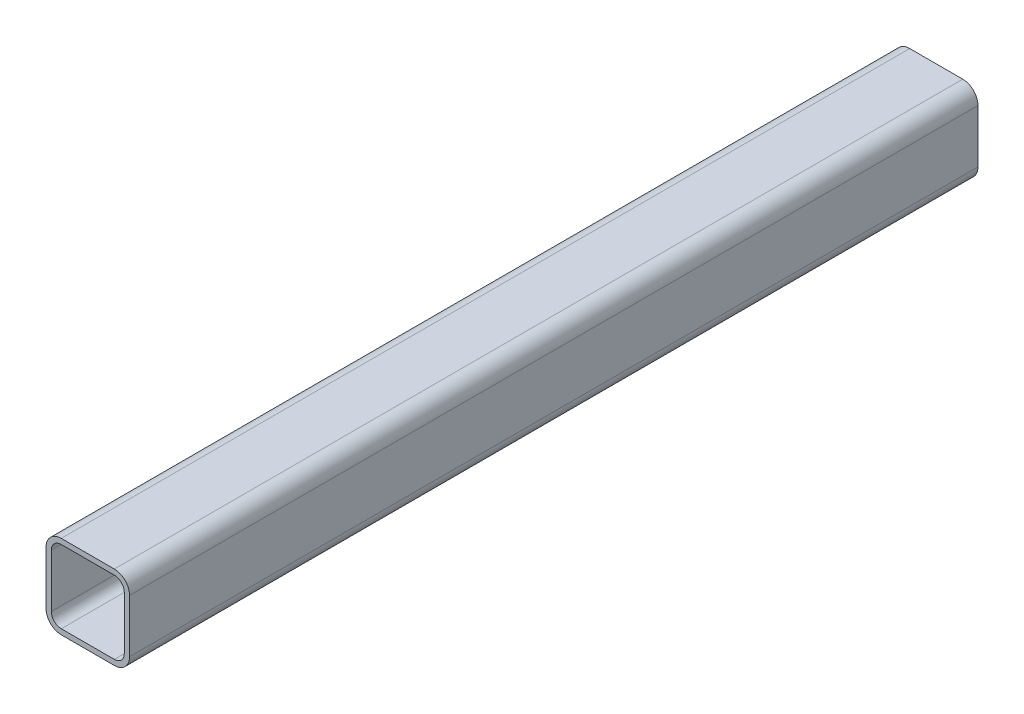
ISO-10303-21;
HEADER;
FILE_DESCRIPTION(('STEP AP214'),'2;1');
FILE_NAME('part.step','',(''),(''),'','','');
FILE_SCHEMA(('AUTOMOTIVE_DESIGN { 1 0 10303 214 1 1 1 1 }'));
ENDSEC;
DATA;
#1=APPLICATION_CONTEXT('core data for automotive mechanical design processes');
#2=APPLICATION_PROTOCOL_DEFINITION('international standard','automotive_design',2000,#1);
#3=PRODUCT_CONTEXT('',#1,'mechanical');
#4=PRODUCT('Part','Part','',(#3));
#5=PRODUCT_RELATED_PRODUCT_CATEGORY('part','',(#4));
#6=PRODUCT_DEFINITION_FORMATION('','',#4);
#7=PRODUCT_DEFINITION_CONTEXT('part definition',#1,'design');
#8=PRODUCT_DEFINITION('design','',#6,#7);
#9=PRODUCT_DEFINITION_SHAPE('','',#8);
#10=(LENGTH_UNIT() NAMED_UNIT(*) SI_UNIT(.MILLI.,.METRE.));
#11=(NAMED_UNIT(*) PLANE_ANGLE_UNIT() SI_UNIT($,.RADIAN.));
#12=(NAMED_UNIT(*) SI_UNIT($,.STERADIAN.) SOLID_ANGLE_UNIT());
#13=UNCERTAINTY_MEASURE_WITH_UNIT(LENGTH_MEASURE(1.E-05),#10,'distance_accuracy_value','');
#14=(GEOMETRIC_REPRESENTATION_CONTEXT(3) GLOBAL_UNCERTAINTY_ASSIGNED_CONTEXT((#13)) GLOBAL_UNIT_ASSIGNED_CONTEXT((#10,
#11,#12)) REPRESENTATION_CONTEXT('',''));
#15=CARTESIAN_POINT('',(0.,0.,0.));
#16=DIRECTION('',(0.,0.,1.));
#17=DIRECTION('',(1.,0.,0.));
#18=AXIS2_PLACEMENT_3D('',#15,#16,#17);
#19=CARTESIAN_POINT('',(-15.0114,-15.0114,-152.4));
#20=DIRECTION('',(0.,0.,1.));
#21=DIRECTION('',(1.,0.,0.));
#22=AXIS2_PLACEMENT_3D('',#19,#20,#21);
#23=PLANE('',#22);
#24=DIRECTION('',(0.,1.,0.));
#25=VECTOR('',#24,1.);
#26=CARTESIAN_POINT('',(-13.1064,0.,-152.4));
#27=LINE('',#26,#25);
#28=CARTESIAN_POINT('',(-13.1064,-9.53452500032133,-152.4));
#29=VERTEX_POINT('',#28);
#30=CARTESIAN_POINT('',(-13.1064,9.53452499999941,-152.4));
#31=VERTEX_POINT('',#30);
#32=EDGE_CURVE('E157',#29,#31,#27,.T.);
#33=ORIENTED_EDGE('',*,*,#32,.F.);
#34=CARTESIAN_POINT('',(-9.534525,-9.53452500000119,-152.4));
#35=DIRECTION('',(0.,0.,-1.));
#36=DIRECTION('',(0.,1.,0.));
#37=AXIS2_PLACEMENT_3D('',#34,#35,#36);
#38=CIRCLE('',#37,3.571875);
#39=CARTESIAN_POINT('',(-9.53452499931297,-13.1064,-152.4));
#40=VERTEX_POINT('',#39);
#41=EDGE_CURVE('E208',#40,#29,#38,.T.);
#42=ORIENTED_EDGE('',*,*,#41,.F.);
#43=DIRECTION('',(-1.,0.,0.));
#44=VECTOR('',#43,1.);
#45=CARTESIAN_POINT('',(0.,-13.1064,-152.4));
#46=LINE('',#45,#44);
#47=CARTESIAN_POINT('',(9.534525,-13.1064,-152.4));
#48=VERTEX_POINT('',#47);
#49=EDGE_CURVE('E153',#48,#40,#46,.T.);
#50=ORIENTED_EDGE('',*,*,#49,.F.);
#51=CARTESIAN_POINT('',(9.534525,-9.53452500000119,-152.4));
#52=DIRECTION('',(0.,0.,-1.));
#53=DIRECTION('',(0.,1.,0.));
#54=AXIS2_PLACEMENT_3D('',#51,#52,#53);
#55=CIRCLE('',#54,3.571875);
#56=CARTESIAN_POINT('',(13.1064,-9.5345250007332,-152.4));
#57=VERTEX_POINT('',#56);
#58=EDGE_CURVE('E212',#57,#48,#55,.T.);
#59=ORIENTED_EDGE('',*,*,#58,.F.);
#60=DIRECTION('',(0.,-1.,0.));
#61=VECTOR('',#60,1.);
#62=CARTESIAN_POINT('',(13.1064,0.,-152.4));
#63=LINE('',#62,#61);
#64=CARTESIAN_POINT('',(13.1064,9.53452499999941,-152.4));
#65=VERTEX_POINT('',#64);
#66=EDGE_CURVE('E162',#65,#57,#63,.T.);
#67=ORIENTED_EDGE('',*,*,#66,.F.);
#68=CARTESIAN_POINT('',(9.534525,9.53452499999882,-152.4));
#69=DIRECTION('',(0.,0.,-1.));
#70=DIRECTION('',(0.,1.,0.));
#71=AXIS2_PLACEMENT_3D('',#68,#69,#70);
#72=CIRCLE('',#71,3.571875);
#73=CARTESIAN_POINT('',(9.5345250003663,13.1064,-152.4));
#74=VERTEX_POINT('',#73);
#75=EDGE_CURVE('E215',#74,#65,#72,.T.);
#76=ORIENTED_EDGE('',*,*,#75,.F.);
#77=DIRECTION('',(1.,0.,0.));
#78=VECTOR('',#77,1.);
#79=CARTESIAN_POINT('',(0.,13.1064,-152.4));
#80=LINE('',#79,#78);
#81=CARTESIAN_POINT('',(-9.534525,13.1064,-152.4));
#82=VERTEX_POINT('',#81);
#83=EDGE_CURVE('E167',#82,#74,#80,.T.);
#84=ORIENTED_EDGE('',*,*,#83,.F.);
#85=CARTESIAN_POINT('',(-9.534525,9.53452499999882,-152.4));
#86=DIRECTION('',(0.,0.,-1.));
#87=DIRECTION('',(0.,1.,0.));
#88=AXIS2_PLACEMENT_3D('',#85,#86,#87);
#89=CIRCLE('',#88,3.571875);
#90=EDGE_CURVE('E160',#31,#82,#89,.T.);
#91=ORIENTED_EDGE('',*,*,#90,.F.);
#92=EDGE_LOOP('',(#33,#42,#50,#59,#67,#76,#84,#91));
#93=FACE_BOUND('',#92,.T.);
#94=DIRECTION('',(0.,-1.,0.));
#95=VECTOR('',#94,1.);
#96=CARTESIAN_POINT('',(15.0114,0.,-152.4));
#97=LINE('',#96,#95);
#98=CARTESIAN_POINT('',(15.0114,9.53452499999962,-152.4));
#99=VERTEX_POINT('',#98);
#100=CARTESIAN_POINT('',(15.0114,-9.53452500000039,-152.4));
#101=VERTEX_POINT('',#100);
#102=EDGE_CURVE('E161',#99,#101,#97,.T.);
#103=ORIENTED_EDGE('',*,*,#102,.T.);
#104=CARTESIAN_POINT('',(9.534525,-9.53452500000077,-152.4));
#105=DIRECTION('',(0.,0.,-1.));
#106=DIRECTION('',(0.,1.,0.));
#107=AXIS2_PLACEMENT_3D('',#104,#105,#106);
#108=CIRCLE('',#107,5.476875);
#109=CARTESIAN_POINT('',(9.53452500105345,-15.0114,-152.4));
#110=VERTEX_POINT('',#109);
#111=EDGE_CURVE('E220',#101,#110,#108,.T.);
#112=ORIENTED_EDGE('',*,*,#111,.T.);
#113=DIRECTION('',(-1.,0.,0.));
#114=VECTOR('',#113,1.);
#115=CARTESIAN_POINT('',(0.,-15.0114,-152.4));
#116=LINE('',#115,#114);
#117=CARTESIAN_POINT('',(-9.534525,-15.0114,-152.4));
#118=VERTEX_POINT('',#117);
#119=EDGE_CURVE('E173',#110,#118,#116,.T.);
#120=ORIENTED_EDGE('',*,*,#119,.T.);
#121=CARTESIAN_POINT('',(-9.534525,-9.53452500000077,-152.4));
#122=DIRECTION('',(0.,0.,-1.));
#123=DIRECTION('',(0.,1.,0.));
#124=AXIS2_PLACEMENT_3D('',#121,#122,#123);
#125=CIRCLE('',#124,5.476875);
#126=CARTESIAN_POINT('',(-15.0114,-9.53452500049218,-152.4));
#127=VERTEX_POINT('',#126);
#128=EDGE_CURVE('E224',#118,#127,#125,.T.);
#129=ORIENTED_EDGE('',*,*,#128,.T.);
#130=DIRECTION('',(0.,1.,0.));
#131=VECTOR('',#130,1.);
#132=CARTESIAN_POINT('',(-15.0114,0.,-152.4));
#133=LINE('',#132,#131);
#134=CARTESIAN_POINT('',(-15.0114,9.53452499999962,-152.4));
#135=VERTEX_POINT('',#134);
#136=EDGE_CURVE('E178',#127,#135,#133,.T.);
#137=ORIENTED_EDGE('',*,*,#136,.T.);
#138=CARTESIAN_POINT('',(-9.534525,9.53452499999923,-152.4));
#139=DIRECTION('',(0.,0.,-1.));
#140=DIRECTION('',(0.,1.,0.));
#141=AXIS2_PLACEMENT_3D('',#138,#139,#140);
#142=CIRCLE('',#141,5.476875);
#143=CARTESIAN_POINT('',(-9.53452499943834,15.0114,-152.4));
#144=VERTEX_POINT('',#143);
#145=EDGE_CURVE('E140',#135,#144,#142,.T.);
#146=ORIENTED_EDGE('',*,*,#145,.T.);
#147=DIRECTION('',(1.,0.,0.));
#148=VECTOR('',#147,1.);
#149=CARTESIAN_POINT('',(0.,15.0114,-152.4));
#150=LINE('',#149,#148);
#151=CARTESIAN_POINT('',(9.534525,15.0114,-152.4));
#152=VERTEX_POINT('',#151);
#153=EDGE_CURVE('E138',#144,#152,#150,.T.);
#154=ORIENTED_EDGE('',*,*,#153,.T.);
#155=CARTESIAN_POINT('',(9.534525,9.53452499999923,-152.4));
#156=DIRECTION('',(0.,0.,-1.));
#157=DIRECTION('',(0.,1.,0.));
#158=AXIS2_PLACEMENT_3D('',#155,#156,#157);
#159=CIRCLE('',#158,5.476875);
#160=EDGE_CURVE('E19',#152,#99,#159,.T.);
#161=ORIENTED_EDGE('',*,*,#160,.T.);
#162=EDGE_LOOP('',(#103,#112,#120,#129,#137,#146,#154,#161));
#163=FACE_BOUND('',#162,.T.);
#164=ADVANCED_FACE('F15',(#93,#163),#23,.F.);
#165=CARTESIAN_POINT('',(9.534525,9.534525,152.4));
#166=DIRECTION('',(0.,0.,-1.));
#167=DIRECTION('',(0.,1.,0.));
#168=AXIS2_PLACEMENT_3D('',#165,#166,#167);
#169=CYLINDRICAL_SURFACE('',#168,5.476875);
#170=DIRECTION('',(0.,0.,1.));
#171=VECTOR('',#170,1.);
#172=CARTESIAN_POINT('',(9.534525,15.0114,0.));
#173=LINE('',#172,#171);
#174=CARTESIAN_POINT('',(9.534525,15.0114,152.4));
#175=VERTEX_POINT('',#174);
#176=EDGE_CURVE('E130',#152,#175,#173,.T.);
#177=ORIENTED_EDGE('',*,*,#176,.T.);
#178=CARTESIAN_POINT('',(9.534525,9.534525,152.4));
#179=DIRECTION('',(0.,0.,-1.));
#180=DIRECTION('',(0.,1.,0.));
#181=AXIS2_PLACEMENT_3D('',#178,#179,#180);
#182=CIRCLE('',#181,5.476875);
#183=CARTESIAN_POINT('',(15.0114,9.534525,152.4));
#184=VERTEX_POINT('',#183);
#185=EDGE_CURVE('E206',#184,#175,#182,.F.);
#186=ORIENTED_EDGE('',*,*,#185,.F.);
#187=DIRECTION('',(0.,0.,-1.));
#188=VECTOR('',#187,1.);
#189=CARTESIAN_POINT('',(15.0114,9.534525,0.));
#190=LINE('',#189,#188);
#191=EDGE_CURVE('E133',#184,#99,#190,.T.);
#192=ORIENTED_EDGE('',*,*,#191,.T.);
#193=ORIENTED_EDGE('',*,*,#160,.F.);
#194=EDGE_LOOP('',(#177,#186,#192,#193));
#195=FACE_BOUND('',#194,.T.);
#196=ADVANCED_FACE('F128',(#195),#169,.T.);
#197=CARTESIAN_POINT('',(-9.534525,15.0114,152.4));
#198=DIRECTION('',(0.,-1.,0.));
#199=DIRECTION('',(0.,0.,-1.));
#200=AXIS2_PLACEMENT_3D('',#197,#198,#199);
#201=PLANE('',#200);
#202=DIRECTION('',(0.,0.,-1.));
#203=VECTOR('',#202,1.);
#204=CARTESIAN_POINT('',(-9.53452499887668,15.0114,0.));
#205=LINE('',#204,#203);
#206=CARTESIAN_POINT('',(-9.53452499943834,15.0114,152.4));
#207=VERTEX_POINT('',#206);
#208=EDGE_CURVE('E143',#144,#207,#205,.F.);
#209=ORIENTED_EDGE('',*,*,#208,.T.);
#210=DIRECTION('',(-1.,0.,0.));
#211=VECTOR('',#210,1.);
#212=CARTESIAN_POINT('',(0.,15.0114,152.4));
#213=LINE('',#212,#211);
#214=EDGE_CURVE('E147',#175,#207,#213,.T.);
#215=ORIENTED_EDGE('',*,*,#214,.F.);
#216=ORIENTED_EDGE('',*,*,#176,.F.);
#217=ORIENTED_EDGE('',*,*,#153,.F.);
#218=EDGE_LOOP('',(#209,#215,#216,#217));
#219=FACE_BOUND('',#218,.T.);
#220=ADVANCED_FACE('F145',(#219),#201,.F.);
#221=CARTESIAN_POINT('',(-9.534525,9.534525,152.4));
#222=DIRECTION('',(0.,0.,-1.));
#223=DIRECTION('',(0.,1.,0.));
#224=AXIS2_PLACEMENT_3D('',#221,#222,#223);
#225=CYLINDRICAL_SURFACE('',#224,5.476875);
#226=DIRECTION('',(0.,0.,1.));
#227=VECTOR('',#226,1.);
#228=CARTESIAN_POINT('',(-15.0114,9.534525,0.));
#229=LINE('',#228,#227);
#230=CARTESIAN_POINT('',(-15.0114,9.534525,152.4));
#231=VERTEX_POINT('',#230);
#232=EDGE_CURVE('E180',#135,#231,#229,.T.);
#233=ORIENTED_EDGE('',*,*,#232,.T.);
#234=CARTESIAN_POINT('',(-9.534525,9.534525,152.4));
#235=DIRECTION('',(0.,0.,-1.));
#236=DIRECTION('',(0.,1.,0.));
#237=AXIS2_PLACEMENT_3D('',#234,#235,#236);
#238=CIRCLE('',#237,5.476875);
#239=EDGE_CURVE('E203',#207,#231,#238,.F.);
#240=ORIENTED_EDGE('',*,*,#239,.F.);
#241=ORIENTED_EDGE('',*,*,#208,.F.);
#242=ORIENTED_EDGE('',*,*,#145,.F.);
#243=EDGE_LOOP('',(#233,#240,#241,#242));
#244=FACE_BOUND('',#243,.T.);
#245=ADVANCED_FACE('F228',(#244),#225,.T.);
#246=CARTESIAN_POINT('',(-15.0114,-9.534525,152.4));
#247=DIRECTION('',(1.,0.,0.));
#248=DIRECTION('',(0.,0.,-1.));
#249=AXIS2_PLACEMENT_3D('',#246,#247,#248);
#250=PLANE('',#249);
#251=DIRECTION('',(0.,0.,-1.));
#252=VECTOR('',#251,1.);
#253=CARTESIAN_POINT('',(-15.0114,-9.53452500098358,0.));
#254=LINE('',#253,#252);
#255=CARTESIAN_POINT('',(-15.0114,-9.53452500049179,152.4));
#256=VERTEX_POINT('',#255);
#257=EDGE_CURVE('E179',#127,#256,#254,.F.);
#258=ORIENTED_EDGE('',*,*,#257,.T.);
#259=DIRECTION('',(0.,-1.,0.));
#260=VECTOR('',#259,1.);
#261=CARTESIAN_POINT('',(-15.0114,0.,152.4));
#262=LINE('',#261,#260);
#263=EDGE_CURVE('E202',#231,#256,#262,.T.);
#264=ORIENTED_EDGE('',*,*,#263,.F.);
#265=ORIENTED_EDGE('',*,*,#232,.F.);
#266=ORIENTED_EDGE('',*,*,#136,.F.);
#267=EDGE_LOOP('',(#258,#264,#265,#266));
#268=FACE_BOUND('',#267,.T.);
#269=ADVANCED_FACE('F260',(#268),#250,.F.);
#270=CARTESIAN_POINT('',(-9.534525,-9.534525,152.4));
#271=DIRECTION('',(0.,0.,-1.));
#272=DIRECTION('',(0.,1.,0.));
#273=AXIS2_PLACEMENT_3D('',#270,#271,#272);
#274=CYLINDRICAL_SURFACE('',#273,5.476875);
#275=DIRECTION('',(0.,0.,1.));
#276=VECTOR('',#275,1.);
#277=CARTESIAN_POINT('',(-9.534525,-15.0114,0.));
#278=LINE('',#277,#276);
#279=CARTESIAN_POINT('',(-9.534525,-15.0114,152.4));
#280=VERTEX_POINT('',#279);
#281=EDGE_CURVE('E177',#118,#280,#278,.T.);
#282=ORIENTED_EDGE('',*,*,#281,.T.);
#283=CARTESIAN_POINT('',(-9.534525,-9.534525,152.4));
#284=DIRECTION('',(0.,0.,-1.));
#285=DIRECTION('',(0.,1.,0.));
#286=AXIS2_PLACEMENT_3D('',#283,#284,#285);
#287=CIRCLE('',#286,5.476875);
#288=EDGE_CURVE('E199',#256,#280,#287,.F.);
#289=ORIENTED_EDGE('',*,*,#288,.F.);
#290=ORIENTED_EDGE('',*,*,#257,.F.);
#291=ORIENTED_EDGE('',*,*,#128,.F.);
#292=EDGE_LOOP('',(#282,#289,#290,#291));
#293=FACE_BOUND('',#292,.T.);
#294=ADVANCED_FACE('F262',(#293),#274,.T.);
#295=CARTESIAN_POINT('',(-9.534525,-15.0114,-152.4));
#296=DIRECTION('',(0.,1.,0.));
#297=DIRECTION('',(0.,0.,1.));
#298=AXIS2_PLACEMENT_3D('',#295,#296,#297);
#299=PLANE('',#298);
#300=DIRECTION('',(0.,0.,-1.));
#301=VECTOR('',#300,1.);
#302=CARTESIAN_POINT('',(9.5345250021069,-15.0114,0.));
#303=LINE('',#302,#301);
#304=CARTESIAN_POINT('',(9.53452500105345,-15.0114,152.4));
#305=VERTEX_POINT('',#304);
#306=EDGE_CURVE('E176',#110,#305,#303,.F.);
#307=ORIENTED_EDGE('',*,*,#306,.T.);
#308=DIRECTION('',(1.,0.,0.));
#309=VECTOR('',#308,1.);
#310=CARTESIAN_POINT('',(0.,-15.0114,152.4));
#311=LINE('',#310,#309);
#312=EDGE_CURVE('E198',#280,#305,#311,.T.);
#313=ORIENTED_EDGE('',*,*,#312,.F.);
#314=ORIENTED_EDGE('',*,*,#281,.F.);
#315=ORIENTED_EDGE('',*,*,#119,.F.);
#316=EDGE_LOOP('',(#307,#313,#314,#315));
#317=FACE_BOUND('',#316,.T.);
#318=ADVANCED_FACE('F318',(#317),#299,.F.);
#319=CARTESIAN_POINT('',(9.534525,-9.534525,152.4));
#320=DIRECTION('',(0.,0.,-1.));
#321=DIRECTION('',(0.,1.,0.));
#322=AXIS2_PLACEMENT_3D('',#319,#320,#321);
#323=CYLINDRICAL_SURFACE('',#322,5.476875);
#324=DIRECTION('',(0.,0.,1.));
#325=VECTOR('',#324,1.);
#326=CARTESIAN_POINT('',(15.0114,-9.534525,0.));
#327=LINE('',#326,#325);
#328=CARTESIAN_POINT('',(15.0114,-9.534525,152.4));
#329=VERTEX_POINT('',#328);
#330=EDGE_CURVE('E223',#101,#329,#327,.T.);
#331=ORIENTED_EDGE('',*,*,#330,.T.);
#332=CARTESIAN_POINT('',(9.534525,-9.534525,152.4));
#333=DIRECTION('',(0.,0.,-1.));
#334=DIRECTION('',(0.,1.,0.));
#335=AXIS2_PLACEMENT_3D('',#332,#333,#334);
#336=CIRCLE('',#335,5.476875);
#337=EDGE_CURVE('E194',#305,#329,#336,.F.);
#338=ORIENTED_EDGE('',*,*,#337,.F.);
#339=ORIENTED_EDGE('',*,*,#306,.F.);
#340=ORIENTED_EDGE('',*,*,#111,.F.);
#341=EDGE_LOOP('',(#331,#338,#339,#340));
#342=FACE_BOUND('',#341,.T.);
#343=ADVANCED_FACE('F314',(#342),#323,.T.);
#344=CARTESIAN_POINT('',(15.0114,-9.534525,-152.4));
#345=DIRECTION('',(-1.,0.,0.));
#346=DIRECTION('',(0.,0.,1.));
#347=AXIS2_PLACEMENT_3D('',#344,#345,#346);
#348=PLANE('',#347);
#349=ORIENTED_EDGE('',*,*,#191,.F.);
#350=DIRECTION('',(0.,1.,0.));
#351=VECTOR('',#350,1.);
#352=CARTESIAN_POINT('',(15.0114,0.,152.4));
#353=LINE('',#352,#351);
#354=EDGE_CURVE('E197',#329,#184,#353,.T.);
#355=ORIENTED_EDGE('',*,*,#354,.F.);
#356=ORIENTED_EDGE('',*,*,#330,.F.);
#357=ORIENTED_EDGE('',*,*,#102,.F.);
#358=EDGE_LOOP('',(#349,#355,#356,#357));
#359=FACE_BOUND('',#358,.T.);
#360=ADVANCED_FACE('F317',(#359),#348,.F.);
#361=CARTESIAN_POINT('',(-13.1064,-9.534525,152.4));
#362=DIRECTION('',(1.,0.,0.));
#363=DIRECTION('',(0.,0.,-1.));
#364=AXIS2_PLACEMENT_3D('',#361,#362,#363);
#365=PLANE('',#364);
#366=DIRECTION('',(0.,1.,0.));
#367=VECTOR('',#366,1.);
#368=CARTESIAN_POINT('',(-13.1063999894844,0.,152.4));
#369=LINE('',#368,#367);
#370=CARTESIAN_POINT('',(-13.1063999947422,-9.53452500032073,152.4));
#371=VERTEX_POINT('',#370);
#372=CARTESIAN_POINT('',(-13.1063999947422,9.534525,152.4));
#373=VERTEX_POINT('',#372);
#374=EDGE_CURVE('E193',#371,#373,#369,.T.);
#375=ORIENTED_EDGE('',*,*,#374,.F.);
#376=DIRECTION('',(0.,0.,-1.));
#377=VECTOR('',#376,1.);
#378=CARTESIAN_POINT('',(-13.1064,-9.53452500064146,0.));
#379=LINE('',#378,#377);
#380=EDGE_CURVE('E211',#29,#371,#379,.F.);
#381=ORIENTED_EDGE('',*,*,#380,.F.);
#382=ORIENTED_EDGE('',*,*,#32,.T.);
#383=DIRECTION('',(0.,0.,1.));
#384=VECTOR('',#383,1.);
#385=CARTESIAN_POINT('',(-13.1064,9.534525,0.));
#386=LINE('',#385,#384);
#387=EDGE_CURVE('E171',#373,#31,#386,.F.);
#388=ORIENTED_EDGE('',*,*,#387,.F.);
#389=EDGE_LOOP('',(#375,#381,#382,#388));
#390=FACE_BOUND('',#389,.T.);
#391=ADVANCED_FACE('F297',(#390),#365,.T.);
#392=CARTESIAN_POINT('',(-9.534525,9.534525,152.4));
#393=DIRECTION('',(0.,0.,-1.));
#394=DIRECTION('',(0.,1.,0.));
#395=AXIS2_PLACEMENT_3D('',#392,#393,#394);
#396=CYLINDRICAL_SURFACE('',#395,3.571875);
#397=CARTESIAN_POINT('',(-9.534525,9.534525,152.4));
#398=DIRECTION('',(0.,0.,-1.));
#399=DIRECTION('',(0.,1.,0.));
#400=AXIS2_PLACEMENT_3D('',#397,#398,#399);
#401=CIRCLE('',#400,3.571875);
#402=CARTESIAN_POINT('',(-9.534525,13.1063999947422,152.4));
#403=VERTEX_POINT('',#402);
#404=EDGE_CURVE('E190',#373,#403,#401,.T.);
#405=ORIENTED_EDGE('',*,*,#404,.F.);
#406=ORIENTED_EDGE('',*,*,#387,.T.);
#407=ORIENTED_EDGE('',*,*,#90,.T.);
#408=DIRECTION('',(0.,0.,-1.));
#409=VECTOR('',#408,1.);
#410=CARTESIAN_POINT('',(-9.534525,13.1064,0.));
#411=LINE('',#410,#409);
#412=EDGE_CURVE('E170',#403,#82,#411,.T.);
#413=ORIENTED_EDGE('',*,*,#412,.F.);
#414=EDGE_LOOP('',(#405,#406,#407,#413));
#415=FACE_BOUND('',#414,.T.);
#416=ADVANCED_FACE('F294',(#415),#396,.F.);
#417=CARTESIAN_POINT('',(-9.534525,13.1064,152.4));
#418=DIRECTION('',(0.,-1.,0.));
#419=DIRECTION('',(0.,0.,-1.));
#420=AXIS2_PLACEMENT_3D('',#417,#418,#419);
#421=PLANE('',#420);
#422=DIRECTION('',(1.,0.,0.));
#423=VECTOR('',#422,1.);
#424=CARTESIAN_POINT('',(0.,13.1063999894844,152.4));
#425=LINE('',#424,#423);
#426=CARTESIAN_POINT('',(9.5345250003663,13.1063999947422,152.4));
#427=VERTEX_POINT('',#426);
#428=EDGE_CURVE('E189',#403,#427,#425,.T.);
#429=ORIENTED_EDGE('',*,*,#428,.F.);
#430=ORIENTED_EDGE('',*,*,#412,.T.);
#431=ORIENTED_EDGE('',*,*,#83,.T.);
#432=DIRECTION('',(0.,0.,1.));
#433=VECTOR('',#432,1.);
#434=CARTESIAN_POINT('',(9.53452500073261,13.1064,0.));
#435=LINE('',#434,#433);
#436=EDGE_CURVE('E166',#427,#74,#435,.F.);
#437=ORIENTED_EDGE('',*,*,#436,.F.);
#438=EDGE_LOOP('',(#429,#430,#431,#437));
#439=FACE_BOUND('',#438,.T.);
#440=ADVANCED_FACE('F291',(#439),#421,.T.);
#441=CARTESIAN_POINT('',(9.534525,9.534525,152.4));
#442=DIRECTION('',(0.,0.,-1.));
#443=DIRECTION('',(0.,1.,0.));
#444=AXIS2_PLACEMENT_3D('',#441,#442,#443);
#445=CYLINDRICAL_SURFACE('',#444,3.571875);
#446=CARTESIAN_POINT('',(9.534525,9.534525,152.4));
#447=DIRECTION('',(0.,0.,-1.));
#448=DIRECTION('',(0.,1.,0.));
#449=AXIS2_PLACEMENT_3D('',#446,#447,#448);
#450=CIRCLE('',#449,3.571875);
#451=CARTESIAN_POINT('',(13.1063999947422,9.534525,152.4));
#452=VERTEX_POINT('',#451);
#453=EDGE_CURVE('E186',#427,#452,#450,.T.);
#454=ORIENTED_EDGE('',*,*,#453,.F.);
#455=ORIENTED_EDGE('',*,*,#436,.T.);
#456=ORIENTED_EDGE('',*,*,#75,.T.);
#457=DIRECTION('',(0.,0.,-1.));
#458=VECTOR('',#457,1.);
#459=CARTESIAN_POINT('',(13.1064,9.534525,0.));
#460=LINE('',#459,#458);
#461=EDGE_CURVE('E165',#452,#65,#460,.T.);
#462=ORIENTED_EDGE('',*,*,#461,.F.);
#463=EDGE_LOOP('',(#454,#455,#456,#462));
#464=FACE_BOUND('',#463,.T.);
#465=ADVANCED_FACE('F288',(#464),#445,.F.);
#466=CARTESIAN_POINT('',(13.1064,-9.534525,-152.4));
#467=DIRECTION('',(-1.,0.,0.));
#468=DIRECTION('',(0.,0.,1.));
#469=AXIS2_PLACEMENT_3D('',#466,#467,#468);
#470=PLANE('',#469);
#471=DIRECTION('',(0.,-1.,0.));
#472=VECTOR('',#471,1.);
#473=CARTESIAN_POINT('',(13.1063999894844,0.,152.4));
#474=LINE('',#473,#472);
#475=CARTESIAN_POINT('',(13.1063999947422,-9.53452500073261,152.4));
#476=VERTEX_POINT('',#475);
#477=EDGE_CURVE('E185',#452,#476,#474,.T.);
#478=ORIENTED_EDGE('',*,*,#477,.F.);
#479=ORIENTED_EDGE('',*,*,#461,.T.);
#480=ORIENTED_EDGE('',*,*,#66,.T.);
#481=DIRECTION('',(0.,0.,1.));
#482=VECTOR('',#481,1.);
#483=CARTESIAN_POINT('',(13.1064,-9.53452500146521,0.));
#484=LINE('',#483,#482);
#485=EDGE_CURVE('E156',#476,#57,#484,.F.);
#486=ORIENTED_EDGE('',*,*,#485,.F.);
#487=EDGE_LOOP('',(#478,#479,#480,#486));
#488=FACE_BOUND('',#487,.T.);
#489=ADVANCED_FACE('F285',(#488),#470,.T.);
#490=CARTESIAN_POINT('',(9.534525,-9.534525,152.4));
#491=DIRECTION('',(0.,0.,-1.));
#492=DIRECTION('',(0.,1.,0.));
#493=AXIS2_PLACEMENT_3D('',#490,#491,#492);
#494=CYLINDRICAL_SURFACE('',#493,3.571875);
#495=CARTESIAN_POINT('',(9.534525,-9.534525,152.4));
#496=DIRECTION('',(0.,0.,-1.));
#497=DIRECTION('',(0.,1.,0.));
#498=AXIS2_PLACEMENT_3D('',#495,#496,#497);
#499=CIRCLE('',#498,3.571875);
#500=CARTESIAN_POINT('',(9.534525,-13.1063999947422,152.4));
#501=VERTEX_POINT('',#500);
#502=EDGE_CURVE('E182',#476,#501,#499,.T.);
#503=ORIENTED_EDGE('',*,*,#502,.F.);
#504=ORIENTED_EDGE('',*,*,#485,.T.);
#505=ORIENTED_EDGE('',*,*,#58,.T.);
#506=DIRECTION('',(0.,0.,-1.));
#507=VECTOR('',#506,1.);
#508=CARTESIAN_POINT('',(9.534525,-13.1064,0.));
#509=LINE('',#508,#507);
#510=EDGE_CURVE('E155',#501,#48,#509,.T.);
#511=ORIENTED_EDGE('',*,*,#510,.F.);
#512=EDGE_LOOP('',(#503,#504,#505,#511));
#513=FACE_BOUND('',#512,.T.);
#514=ADVANCED_FACE('F281',(#513),#494,.F.);
#515=CARTESIAN_POINT('',(-9.534525,-13.1064,-152.4));
#516=DIRECTION('',(0.,1.,0.));
#517=DIRECTION('',(0.,0.,1.));
#518=AXIS2_PLACEMENT_3D('',#515,#516,#517);
#519=PLANE('',#518);
#520=DIRECTION('',(-1.,0.,0.));
#521=VECTOR('',#520,1.);
#522=CARTESIAN_POINT('',(0.,-13.1063999894844,152.4));
#523=LINE('',#522,#521);
#524=CARTESIAN_POINT('',(-9.53452499931297,-13.1063999947422,152.4));
#525=VERTEX_POINT('',#524);
#526=EDGE_CURVE('E25',#501,#525,#523,.T.);
#527=ORIENTED_EDGE('',*,*,#526,.F.);
#528=ORIENTED_EDGE('',*,*,#510,.T.);
#529=ORIENTED_EDGE('',*,*,#49,.T.);
#530=DIRECTION('',(0.,0.,1.));
#531=VECTOR('',#530,1.);
#532=CARTESIAN_POINT('',(-9.53452499862594,-13.1064,0.));
#533=LINE('',#532,#531);
#534=EDGE_CURVE('E34',#525,#40,#533,.F.);
#535=ORIENTED_EDGE('',*,*,#534,.F.);
#536=EDGE_LOOP('',(#527,#528,#529,#535));
#537=FACE_BOUND('',#536,.T.);
#538=ADVANCED_FACE('F279',(#537),#519,.T.);
#539=CARTESIAN_POINT('',(-9.534525,-9.534525,152.4));
#540=DIRECTION('',(0.,0.,-1.));
#541=DIRECTION('',(0.,1.,0.));
#542=AXIS2_PLACEMENT_3D('',#539,#540,#541);
#543=CYLINDRICAL_SURFACE('',#542,3.571875);
#544=CARTESIAN_POINT('',(-9.534525,-9.534525,152.4));
#545=DIRECTION('',(0.,0.,-1.));
#546=DIRECTION('',(0.,1.,0.));
#547=AXIS2_PLACEMENT_3D('',#544,#545,#546);
#548=CIRCLE('',#547,3.571875);
#549=EDGE_CURVE('E9',#525,#371,#548,.T.);
#550=ORIENTED_EDGE('',*,*,#549,.F.);
#551=ORIENTED_EDGE('',*,*,#534,.T.);
#552=ORIENTED_EDGE('',*,*,#41,.T.);
#553=ORIENTED_EDGE('',*,*,#380,.T.);
#554=EDGE_LOOP('',(#550,#551,#552,#553));
#555=FACE_BOUND('',#554,.T.);
#556=ADVANCED_FACE('F299',(#555),#543,.F.);
#557=CARTESIAN_POINT('',(-15.0114,-15.0114,152.4));
#558=DIRECTION('',(0.,0.,1.));
#559=DIRECTION('',(1.,0.,0.));
#560=AXIS2_PLACEMENT_3D('',#557,#558,#559);
#561=PLANE('',#560);
#562=ORIENTED_EDGE('',*,*,#526,.T.);
#563=ORIENTED_EDGE('',*,*,#549,.T.);
#564=ORIENTED_EDGE('',*,*,#374,.T.);
#565=ORIENTED_EDGE('',*,*,#404,.T.);
#566=ORIENTED_EDGE('',*,*,#428,.T.);
#567=ORIENTED_EDGE('',*,*,#453,.T.);
#568=ORIENTED_EDGE('',*,*,#477,.T.);
#569=ORIENTED_EDGE('',*,*,#502,.T.);
#570=EDGE_LOOP('',(#562,#563,#564,#565,#566,#567,#568,#569));
#571=FACE_BOUND('',#570,.T.);
#572=ORIENTED_EDGE('',*,*,#337,.T.);
#573=ORIENTED_EDGE('',*,*,#354,.T.);
#574=ORIENTED_EDGE('',*,*,#185,.T.);
#575=ORIENTED_EDGE('',*,*,#214,.T.);
#576=ORIENTED_EDGE('',*,*,#239,.T.);
#577=ORIENTED_EDGE('',*,*,#263,.T.);
#578=ORIENTED_EDGE('',*,*,#288,.T.);
#579=ORIENTED_EDGE('',*,*,#312,.T.);
#580=EDGE_LOOP('',(#572,#573,#574,#575,#576,#577,#578,#579));
#581=FACE_BOUND('',#580,.T.);
#582=ADVANCED_FACE('F17',(#571,#581),#561,.T.);
#583=CLOSED_SHELL('',(#164,#196,#220,#245,#269,#294,#318,#343,#360,#391,#416,#440,#465,#489,
#514,#538,#556,#582));
#584=MANIFOLD_SOLID_BREP('B1',#583);
#585=ADVANCED_BREP_SHAPE_REPRESENTATION('',(#18,#584),#14);
#586=SHAPE_DEFINITION_REPRESENTATION(#9,#585);
ENDSEC;
END-ISO-10303-21;
